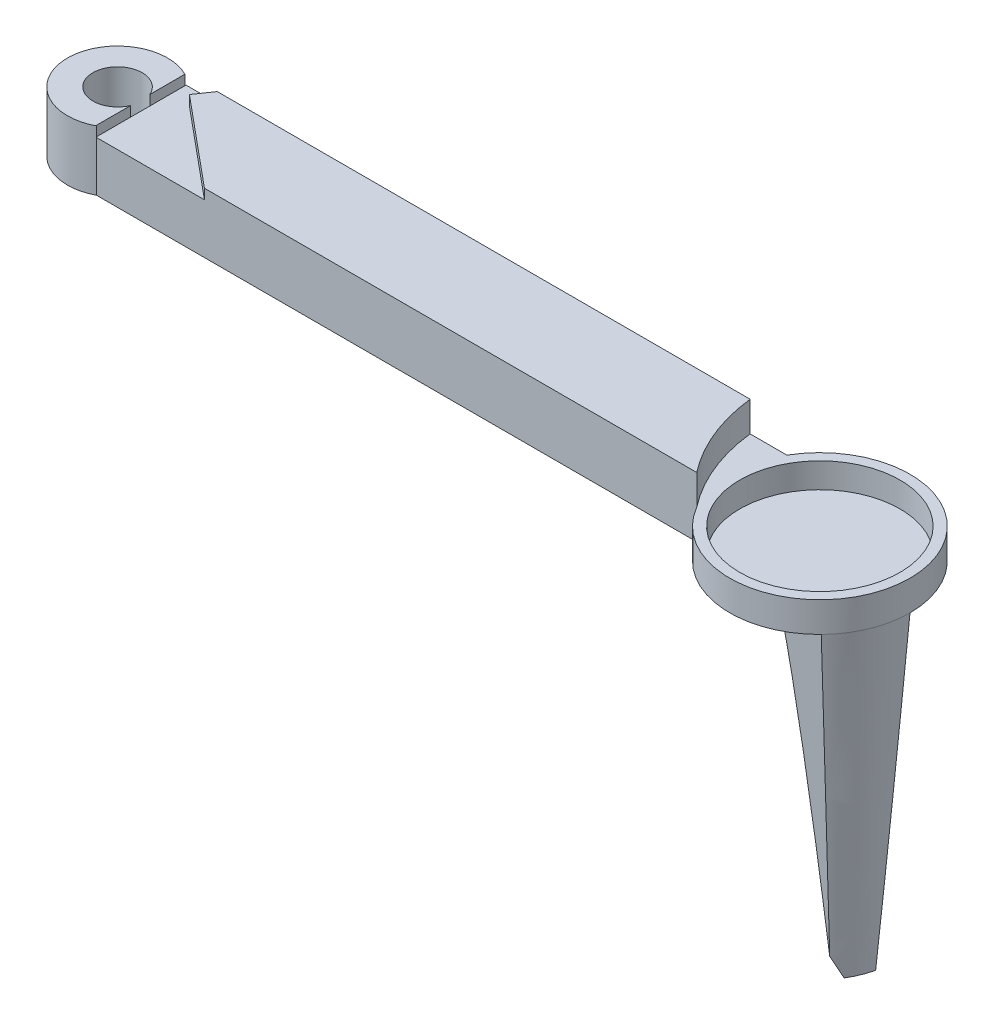
ISO-10303-21;
HEADER;
FILE_DESCRIPTION(('STEP AP214'),'2;1');
FILE_NAME('part.step','',(''),(''),'','','');
FILE_SCHEMA(('AUTOMOTIVE_DESIGN { 1 0 10303 214 1 1 1 1 }'));
ENDSEC;
DATA;
#1=APPLICATION_CONTEXT('core data for automotive mechanical design processes');
#2=APPLICATION_PROTOCOL_DEFINITION('international standard','automotive_design',2000,#1);
#3=PRODUCT_CONTEXT('',#1,'mechanical');
#4=PRODUCT('Part','Part','',(#3));
#5=PRODUCT_RELATED_PRODUCT_CATEGORY('part','',(#4));
#6=PRODUCT_DEFINITION_FORMATION('','',#4);
#7=PRODUCT_DEFINITION_CONTEXT('part definition',#1,'design');
#8=PRODUCT_DEFINITION('design','',#6,#7);
#9=PRODUCT_DEFINITION_SHAPE('','',#8);
#10=(LENGTH_UNIT() NAMED_UNIT(*) SI_UNIT(.MILLI.,.METRE.));
#11=(NAMED_UNIT(*) PLANE_ANGLE_UNIT() SI_UNIT($,.RADIAN.));
#12=(NAMED_UNIT(*) SI_UNIT($,.STERADIAN.) SOLID_ANGLE_UNIT());
#13=UNCERTAINTY_MEASURE_WITH_UNIT(LENGTH_MEASURE(1.E-05),#10,'distance_accuracy_value','');
#14=(GEOMETRIC_REPRESENTATION_CONTEXT(3) GLOBAL_UNCERTAINTY_ASSIGNED_CONTEXT((#13)) GLOBAL_UNIT_ASSIGNED_CONTEXT((#10,
#11,#12)) REPRESENTATION_CONTEXT('',''));
#15=CARTESIAN_POINT('',(0.,0.,0.));
#16=DIRECTION('',(0.,0.,1.));
#17=DIRECTION('',(1.,0.,0.));
#18=AXIS2_PLACEMENT_3D('',#15,#16,#17);
#19=CARTESIAN_POINT('',(0.,5.999999938,-9.));
#20=DIRECTION('',(0.,0.,1.));
#21=DIRECTION('',(1.,0.,0.));
#22=AXIS2_PLACEMENT_3D('',#19,#20,#21);
#23=PLANE('',#22);
#24=DIRECTION('',(0.,-1.,0.));
#25=VECTOR('',#24,1.);
#26=CARTESIAN_POINT('',(3.11768557129798,114.970307966617,-9.));
#27=LINE('',#26,#25);
#28=CARTESIAN_POINT('',(3.11768557129798,5.999999938,-9.));
#29=VERTEX_POINT('',#28);
#30=CARTESIAN_POINT('',(3.11768557129799,4.999999938,-9.));
#31=VERTEX_POINT('',#30);
#32=EDGE_CURVE('E349',#29,#31,#27,.T.);
#33=ORIENTED_EDGE('',*,*,#32,.F.);
#34=DIRECTION('',(-1.,0.,0.));
#35=VECTOR('',#34,1.);
#36=CARTESIAN_POINT('',(0.,5.999999938,-9.));
#37=LINE('',#36,#35);
#38=CARTESIAN_POINT('',(56.3307889829448,5.999999938,-9.));
#39=VERTEX_POINT('',#38);
#40=EDGE_CURVE('E280',#39,#29,#37,.T.);
#41=ORIENTED_EDGE('',*,*,#40,.F.);
#42=DIRECTION('',(0.,-1.,0.));
#43=VECTOR('',#42,1.);
#44=CARTESIAN_POINT('',(56.3307889829448,108.629294651588,-9.));
#45=LINE('',#44,#43);
#46=CARTESIAN_POINT('',(56.3307889829448,2.999999938,-9.));
#47=VERTEX_POINT('',#46);
#48=EDGE_CURVE('E335',#39,#47,#45,.T.);
#49=ORIENTED_EDGE('',*,*,#48,.T.);
#50=DIRECTION('',(-1.,0.,0.));
#51=VECTOR('',#50,1.);
#52=CARTESIAN_POINT('',(0.,2.999999938,-9.));
#53=LINE('',#52,#51);
#54=CARTESIAN_POINT('',(60.,2.999999938,-9.));
#55=VERTEX_POINT('',#54);
#56=EDGE_CURVE('E332',#55,#47,#53,.T.);
#57=ORIENTED_EDGE('',*,*,#56,.F.);
#58=DIRECTION('',(0.,-1.,0.));
#59=VECTOR('',#58,1.);
#60=CARTESIAN_POINT('',(60.,5.999999938,-9.));
#61=LINE('',#60,#59);
#62=CARTESIAN_POINT('',(60.,0.,-9.));
#63=VERTEX_POINT('',#62);
#64=EDGE_CURVE('E300',#55,#63,#61,.T.);
#65=ORIENTED_EDGE('',*,*,#64,.T.);
#66=DIRECTION('',(-1.,0.,0.));
#67=VECTOR('',#66,1.);
#68=CARTESIAN_POINT('',(0.,0.,-9.));
#69=LINE('',#68,#67);
#70=CARTESIAN_POINT('',(0.,0.,-9.));
#71=VERTEX_POINT('',#70);
#72=EDGE_CURVE('E281',#63,#71,#69,.T.);
#73=ORIENTED_EDGE('',*,*,#72,.T.);
#74=DIRECTION('',(0.,-1.,0.));
#75=VECTOR('',#74,1.);
#76=CARTESIAN_POINT('',(0.,5.999999938,-9.));
#77=LINE('',#76,#75);
#78=CARTESIAN_POINT('',(0.,4.999999938,-9.));
#79=VERTEX_POINT('',#78);
#80=EDGE_CURVE('E284',#79,#71,#77,.T.);
#81=ORIENTED_EDGE('',*,*,#80,.F.);
#82=DIRECTION('',(-1.,0.,0.));
#83=VECTOR('',#82,1.);
#84=CARTESIAN_POINT('',(0.,4.999999938,-9.));
#85=LINE('',#84,#83);
#86=EDGE_CURVE('E351',#31,#79,#85,.T.);
#87=ORIENTED_EDGE('',*,*,#86,.F.);
#88=EDGE_LOOP('',(#33,#41,#49,#57,#65,#73,#81,#87));
#89=FACE_BOUND('',#88,.T.);
#90=ADVANCED_FACE('F41',(#89),#23,.F.);
#91=CARTESIAN_POINT('',(0.,5.999999938,0.));
#92=DIRECTION('',(1.,0.,0.));
#93=DIRECTION('',(0.,0.,-1.));
#94=AXIS2_PLACEMENT_3D('',#91,#92,#93);
#95=PLANE('',#94);
#96=DIRECTION('',(0.,0.,1.));
#97=VECTOR('',#96,1.);
#98=CARTESIAN_POINT('',(0.,4.999999938,0.));
#99=LINE('',#98,#97);
#100=CARTESIAN_POINT('',(0.,4.999999938,-8.88252261781532));
#101=VERTEX_POINT('',#100);
#102=EDGE_CURVE('E371',#79,#101,#99,.T.);
#103=ORIENTED_EDGE('',*,*,#102,.F.);
#104=ORIENTED_EDGE('',*,*,#80,.T.);
#105=DIRECTION('',(0.,0.,1.));
#106=VECTOR('',#105,1.);
#107=CARTESIAN_POINT('',(0.,0.,0.));
#108=LINE('',#107,#106);
#109=CARTESIAN_POINT('',(0.,0.,-8.88252261781532));
#110=VERTEX_POINT('',#109);
#111=EDGE_CURVE('E293',#71,#110,#108,.T.);
#112=ORIENTED_EDGE('',*,*,#111,.T.);
#113=DIRECTION('',(0.,1.,0.));
#114=VECTOR('',#113,1.);
#115=CARTESIAN_POINT('',(0.,0.,-8.88252261781532));
#116=LINE('',#115,#114);
#117=EDGE_CURVE('E316',#101,#110,#116,.F.);
#118=ORIENTED_EDGE('',*,*,#117,.F.);
#119=EDGE_LOOP('',(#103,#104,#112,#118));
#120=FACE_BOUND('',#119,.T.);
#121=ADVANCED_FACE('F43',(#120),#95,.F.);
#122=CARTESIAN_POINT('',(67.7942286340599,5.999999938,-4.5));
#123=DIRECTION('',(0.,-1.,0.));
#124=DIRECTION('',(0.,0.,-1.));
#125=AXIS2_PLACEMENT_3D('',#122,#123,#124);
#126=PLANE('',#125);
#127=CARTESIAN_POINT('',(-2.26732885973922,5.999999938,-4.42615415887999));
#128=DIRECTION('',(0.,-1.,0.));
#129=DIRECTION('',(0.,0.,-1.));
#130=AXIS2_PLACEMENT_3D('',#127,#128,#129);
#131=CIRCLE('',#130,5.);
#132=CARTESIAN_POINT('',(0.0584310938736479,5.999999938,0.));
#133=VERTEX_POINT('',#132);
#134=CARTESIAN_POINT('',(0.,5.999999938,-8.88252261781532));
#135=VERTEX_POINT('',#134);
#136=EDGE_CURVE('E322',#133,#135,#131,.T.);
#137=ORIENTED_EDGE('',*,*,#136,.F.);
#138=DIRECTION('',(1.,0.,0.));
#139=VECTOR('',#138,1.);
#140=CARTESIAN_POINT('',(0.,5.999999938,0.));
#141=LINE('',#140,#139);
#142=CARTESIAN_POINT('',(0.,5.999999938,0.));
#143=VERTEX_POINT('',#142);
#144=EDGE_CURVE('E357',#143,#133,#141,.T.);
#145=ORIENTED_EDGE('',*,*,#144,.F.);
#146=DIRECTION('',(0.,0.,1.));
#147=VECTOR('',#146,1.);
#148=CARTESIAN_POINT('',(0.,5.999999938,0.));
#149=LINE('',#148,#147);
#150=CARTESIAN_POINT('',(0.,5.999999938,-3.47178534034408));
#151=VERTEX_POINT('',#150);
#152=EDGE_CURVE('E378',#151,#143,#149,.T.);
#153=ORIENTED_EDGE('',*,*,#152,.F.);
#154=CARTESIAN_POINT('',(-2.26732885973922,5.999999938,-4.42615415887999));
#155=DIRECTION('',(0.,1.,0.));
#156=DIRECTION('',(1.,0.,0.));
#157=AXIS2_PLACEMENT_3D('',#154,#155,#156);
#158=CIRCLE('',#157,2.46);
#159=CARTESIAN_POINT('',(0.,5.999999938,-5.38052297741591));
#160=VERTEX_POINT('',#159);
#161=EDGE_CURVE('E387',#151,#160,#158,.F.);
#162=ORIENTED_EDGE('',*,*,#161,.T.);
#163=EDGE_CURVE('E380',#135,#160,#149,.T.);
#164=ORIENTED_EDGE('',*,*,#163,.F.);
#165=EDGE_LOOP('',(#137,#145,#153,#162,#164));
#166=FACE_BOUND('',#165,.T.);
#167=ADVANCED_FACE('F250',(#166),#126,.F.);
#168=CARTESIAN_POINT('',(0.,4.999999938,-5.38052297741591));
#169=VERTEX_POINT('',#168);
#170=CARTESIAN_POINT('',(0.,4.999999938,-3.47178534034408));
#171=VERTEX_POINT('',#170);
#172=EDGE_CURVE('E416',#169,#171,#99,.T.);
#173=ORIENTED_EDGE('',*,*,#172,.F.);
#174=DIRECTION('',(0.,1.,0.));
#175=VECTOR('',#174,1.);
#176=CARTESIAN_POINT('',(0.,0.,-5.38052297741591));
#177=LINE('',#176,#175);
#178=CARTESIAN_POINT('',(0.,0.,-5.38052297741591));
#179=VERTEX_POINT('',#178);
#180=EDGE_CURVE('E329',#169,#179,#177,.F.);
#181=ORIENTED_EDGE('',*,*,#180,.T.);
#182=CARTESIAN_POINT('',(0.,0.,-3.47178534034408));
#183=VERTEX_POINT('',#182);
#184=EDGE_CURVE('E297',#179,#183,#108,.T.);
#185=ORIENTED_EDGE('',*,*,#184,.T.);
#186=DIRECTION('',(0.,1.,0.));
#187=VECTOR('',#186,1.);
#188=CARTESIAN_POINT('',(0.,0.,-3.47178534034408));
#189=LINE('',#188,#187);
#190=EDGE_CURVE('E326',#183,#171,#189,.T.);
#191=ORIENTED_EDGE('',*,*,#190,.T.);
#192=EDGE_LOOP('',(#173,#181,#185,#191));
#193=FACE_BOUND('',#192,.T.);
#194=ADVANCED_FACE('F252',(#193),#95,.F.);
#195=CARTESIAN_POINT('',(0.,5.999999938,0.));
#196=DIRECTION('',(0.,0.,-1.));
#197=DIRECTION('',(-1.,0.,0.));
#198=AXIS2_PLACEMENT_3D('',#195,#196,#197);
#199=PLANE('',#198);
#200=DIRECTION('',(1.,0.,0.));
#201=VECTOR('',#200,1.);
#202=CARTESIAN_POINT('',(0.,5.999999938,0.));
#203=LINE('',#202,#201);
#204=CARTESIAN_POINT('',(10.8365406297351,5.999999938,0.));
#205=VERTEX_POINT('',#204);
#206=CARTESIAN_POINT('',(60.,5.999999938,0.));
#207=VERTEX_POINT('',#206);
#208=EDGE_CURVE('E274',#205,#207,#203,.T.);
#209=ORIENTED_EDGE('',*,*,#208,.F.);
#210=DIRECTION('',(0.,1.,0.));
#211=VECTOR('',#210,1.);
#212=CARTESIAN_POINT('',(10.8365406297351,4.999999938,0.));
#213=LINE('',#212,#211);
#214=CARTESIAN_POINT('',(10.8365406297351,4.999999938,0.));
#215=VERTEX_POINT('',#214);
#216=EDGE_CURVE('E276',#215,#205,#213,.T.);
#217=ORIENTED_EDGE('',*,*,#216,.F.);
#218=DIRECTION('',(1.,0.,0.));
#219=VECTOR('',#218,1.);
#220=CARTESIAN_POINT('',(0.,4.999999938,0.));
#221=LINE('',#220,#219);
#222=CARTESIAN_POINT('',(0.0584310938736479,4.999999938,0.));
#223=VERTEX_POINT('',#222);
#224=EDGE_CURVE('E313',#223,#215,#221,.T.);
#225=ORIENTED_EDGE('',*,*,#224,.F.);
#226=DIRECTION('',(0.,1.,0.));
#227=VECTOR('',#226,1.);
#228=CARTESIAN_POINT('',(0.0584310938736479,0.,0.));
#229=LINE('',#228,#227);
#230=CARTESIAN_POINT('',(0.0584310938736479,0.,0.));
#231=VERTEX_POINT('',#230);
#232=EDGE_CURVE('E312',#231,#223,#229,.T.);
#233=ORIENTED_EDGE('',*,*,#232,.F.);
#234=DIRECTION('',(1.,0.,0.));
#235=VECTOR('',#234,1.);
#236=CARTESIAN_POINT('',(0.,0.,0.));
#237=LINE('',#236,#235);
#238=CARTESIAN_POINT('',(60.,0.,0.));
#239=VERTEX_POINT('',#238);
#240=EDGE_CURVE('E296',#231,#239,#237,.T.);
#241=ORIENTED_EDGE('',*,*,#240,.T.);
#242=DIRECTION('',(0.,-1.,0.));
#243=VECTOR('',#242,1.);
#244=CARTESIAN_POINT('',(60.,5.999999938,0.));
#245=LINE('',#244,#243);
#246=CARTESIAN_POINT('',(60.,2.999999938,0.));
#247=VERTEX_POINT('',#246);
#248=EDGE_CURVE('E49',#247,#239,#245,.T.);
#249=ORIENTED_EDGE('',*,*,#248,.F.);
#250=EDGE_CURVE('E11',#207,#247,#245,.T.);
#251=ORIENTED_EDGE('',*,*,#250,.F.);
#252=EDGE_LOOP('',(#209,#217,#225,#233,#241,#249,#251));
#253=FACE_BOUND('',#252,.T.);
#254=ADVANCED_FACE('F261',(#253),#199,.F.);
#255=ORIENTED_EDGE('',*,*,#40,.T.);
#256=DIRECTION('',(-0.567216915586704,0.,0.823568437151586));
#257=VECTOR('',#256,1.);
#258=CARTESIAN_POINT('',(1.98325174012457,5.999999938,-7.35286312569683));
#259=LINE('',#258,#257);
#260=CARTESIAN_POINT('',(1.98325174012457,5.999999938,-7.35286312569683));
#261=VERTEX_POINT('',#260);
#262=EDGE_CURVE('E359',#29,#261,#259,.T.);
#263=ORIENTED_EDGE('',*,*,#262,.T.);
#264=DIRECTION('',(-0.769283339281046,0.,-0.638907774177622));
#265=VECTOR('',#264,1.);
#266=CARTESIAN_POINT('',(0.,5.999999938,-9.));
#267=LINE('',#266,#265);
#268=EDGE_CURVE('E375',#205,#261,#267,.T.);
#269=ORIENTED_EDGE('',*,*,#268,.F.);
#270=ORIENTED_EDGE('',*,*,#208,.T.);
#271=CARTESIAN_POINT('',(74.0458842440092,5.999999938,-10.9743186618045));
#272=DIRECTION('',(0.,-1.,0.));
#273=DIRECTION('',(0.,0.,-1.));
#274=AXIS2_PLACEMENT_3D('',#271,#272,#273);
#275=CIRCLE('',#274,17.8247730500822);
#276=EDGE_CURVE('E336',#39,#207,#275,.F.);
#277=ORIENTED_EDGE('',*,*,#276,.F.);
#278=EDGE_LOOP('',(#255,#263,#269,#270,#277));
#279=FACE_BOUND('',#278,.T.);
#280=ADVANCED_FACE('F259',(#279),#126,.F.);
#281=CARTESIAN_POINT('',(67.7942286340599,5.999999938,-4.5));
#282=DIRECTION('',(0.,-1.,0.));
#283=DIRECTION('',(0.,0.,-1.));
#284=AXIS2_PLACEMENT_3D('',#281,#282,#283);
#285=CYLINDRICAL_SURFACE('',#284,9.);
#286=CARTESIAN_POINT('',(67.7942286340599,2.999999938,-4.5));
#287=DIRECTION('',(0.,1.,0.));
#288=DIRECTION('',(0.,0.,1.));
#289=AXIS2_PLACEMENT_3D('',#286,#287,#288);
#290=CIRCLE('',#289,9.);
#291=EDGE_CURVE('E290',#247,#55,#290,.T.);
#292=ORIENTED_EDGE('',*,*,#291,.F.);
#293=ORIENTED_EDGE('',*,*,#248,.T.);
#294=CARTESIAN_POINT('',(67.7942286340599,0.,-4.5));
#295=DIRECTION('',(0.,1.,0.));
#296=DIRECTION('',(0.,0.,-1.));
#297=AXIS2_PLACEMENT_3D('',#294,#295,#296);
#298=CIRCLE('',#297,9.);
#299=CARTESIAN_POINT('',(74.2267072312882,0.,1.79469769696688));
#300=VERTEX_POINT('',#299);
#301=EDGE_CURVE('E287',#239,#300,#298,.T.);
#302=ORIENTED_EDGE('',*,*,#301,.T.);
#303=CARTESIAN_POINT('',(67.7942286340599,0.,-4.50000000000003));
#304=DIRECTION('',(0.,-1.,0.));
#305=DIRECTION('',(0.,0.,1.));
#306=AXIS2_PLACEMENT_3D('',#303,#304,#305);
#307=CIRCLE('',#306,9.00000000000008);
#308=CARTESIAN_POINT('',(76.7942286340599,0.,-4.5));
#309=VERTEX_POINT('',#308);
#310=EDGE_CURVE('E185',#309,#300,#307,.T.);
#311=ORIENTED_EDGE('',*,*,#310,.F.);
#312=EDGE_CURVE('E61',#309,#63,#298,.T.);
#313=ORIENTED_EDGE('',*,*,#312,.T.);
#314=ORIENTED_EDGE('',*,*,#64,.F.);
#315=EDGE_LOOP('',(#292,#293,#302,#311,#313,#314));
#316=FACE_BOUND('',#315,.T.);
#317=ADVANCED_FACE('F257',(#316),#285,.T.);
#318=CARTESIAN_POINT('',(67.7942286340599,0.,-4.5));
#319=DIRECTION('',(0.,-1.,0.));
#320=DIRECTION('',(0.,0.,-1.));
#321=AXIS2_PLACEMENT_3D('',#318,#319,#320);
#322=PLANE('',#321);
#323=DIRECTION('',(1.,0.,0.));
#324=VECTOR('',#323,1.);
#325=CARTESIAN_POINT('',(76.7942286340599,0.,-4.5));
#326=LINE('',#325,#324);
#327=CARTESIAN_POINT('',(72.7942286340599,0.,-4.5));
#328=VERTEX_POINT('',#327);
#329=EDGE_CURVE('E56',#328,#309,#326,.T.);
#330=ORIENTED_EDGE('',*,*,#329,.F.);
#331=CARTESIAN_POINT('',(66.789088629436,0.,-3.27843742358938));
#332=DIRECTION('',(0.,1.,0.));
#333=DIRECTION('',(0.,0.,1.));
#334=AXIS2_PLACEMENT_3D('',#331,#332,#333);
#335=CIRCLE('',#334,6.12812545589774);
#336=CARTESIAN_POINT('',(70.2267072312882,0.,1.79469769696688));
#337=VERTEX_POINT('',#336);
#338=EDGE_CURVE('E165',#337,#328,#335,.T.);
#339=ORIENTED_EDGE('',*,*,#338,.F.);
#340=DIRECTION('',(-1.,0.,0.));
#341=VECTOR('',#340,1.);
#342=CARTESIAN_POINT('',(74.2267072312882,0.,1.79469769696688));
#343=LINE('',#342,#341);
#344=EDGE_CURVE('E170',#300,#337,#343,.T.);
#345=ORIENTED_EDGE('',*,*,#344,.F.);
#346=ORIENTED_EDGE('',*,*,#301,.F.);
#347=ORIENTED_EDGE('',*,*,#240,.F.);
#348=CARTESIAN_POINT('',(-2.26732885973922,0.,-4.42615415887999));
#349=DIRECTION('',(0.,-1.,0.));
#350=DIRECTION('',(0.,0.,-1.));
#351=AXIS2_PLACEMENT_3D('',#348,#349,#350);
#352=CIRCLE('',#351,5.);
#353=EDGE_CURVE('E309',#231,#110,#352,.T.);
#354=ORIENTED_EDGE('',*,*,#353,.T.);
#355=ORIENTED_EDGE('',*,*,#111,.F.);
#356=ORIENTED_EDGE('',*,*,#72,.F.);
#357=ORIENTED_EDGE('',*,*,#312,.F.);
#358=EDGE_LOOP('',(#330,#339,#345,#346,#347,#354,#355,#356,#357));
#359=FACE_BOUND('',#358,.T.);
#360=ORIENTED_EDGE('',*,*,#184,.F.);
#361=CARTESIAN_POINT('',(-2.26732885973922,0.,-4.42615415887999));
#362=DIRECTION('',(0.,1.,0.));
#363=DIRECTION('',(1.,0.,0.));
#364=AXIS2_PLACEMENT_3D('',#361,#362,#363);
#365=CIRCLE('',#364,2.46);
#366=EDGE_CURVE('E388',#183,#179,#365,.F.);
#367=ORIENTED_EDGE('',*,*,#366,.F.);
#368=EDGE_LOOP('',(#360,#367));
#369=FACE_BOUND('',#368,.T.);
#370=ADVANCED_FACE('F167',(#359,#369),#322,.T.);
#371=CARTESIAN_POINT('',(67.7942286340599,2.999999938,-4.5));
#372=DIRECTION('',(0.,1.,0.));
#373=DIRECTION('',(0.,0.,1.));
#374=AXIS2_PLACEMENT_3D('',#371,#372,#373);
#375=PLANE('',#374);
#376=CARTESIAN_POINT('',(67.7942286340599,2.999999938,-4.5));
#377=DIRECTION('',(0.,1.,0.));
#378=DIRECTION('',(0.,0.,1.));
#379=AXIS2_PLACEMENT_3D('',#376,#377,#378);
#380=CIRCLE('',#379,8.);
#381=CARTESIAN_POINT('',(67.7942286340599,2.999999938,3.49999999999999));
#382=VERTEX_POINT('',#381);
#383=EDGE_CURVE('E446',#382,#382,#380,.T.);
#384=ORIENTED_EDGE('',*,*,#383,.F.);
#385=EDGE_LOOP('',(#384));
#386=FACE_BOUND('',#385,.T.);
#387=ORIENTED_EDGE('',*,*,#291,.T.);
#388=ORIENTED_EDGE('',*,*,#56,.T.);
#389=CARTESIAN_POINT('',(74.0458842440092,2.999999938,-10.9743186618045));
#390=DIRECTION('',(0.,-1.,0.));
#391=DIRECTION('',(0.,0.,-1.));
#392=AXIS2_PLACEMENT_3D('',#389,#390,#391);
#393=CIRCLE('',#392,17.8247730500822);
#394=EDGE_CURVE('E333',#47,#247,#393,.F.);
#395=ORIENTED_EDGE('',*,*,#394,.T.);
#396=EDGE_LOOP('',(#387,#388,#395));
#397=FACE_BOUND('',#396,.T.);
#398=ADVANCED_FACE('F341',(#386,#397),#375,.T.);
#399=CARTESIAN_POINT('',(74.0458842440092,108.629294651588,-10.9743186618045));
#400=DIRECTION('',(0.,-1.,0.));
#401=DIRECTION('',(0.,0.,-1.));
#402=AXIS2_PLACEMENT_3D('',#399,#400,#401);
#403=CYLINDRICAL_SURFACE('',#402,17.8247730500822);
#404=ORIENTED_EDGE('',*,*,#276,.T.);
#405=ORIENTED_EDGE('',*,*,#250,.T.);
#406=ORIENTED_EDGE('',*,*,#394,.F.);
#407=ORIENTED_EDGE('',*,*,#48,.F.);
#408=EDGE_LOOP('',(#404,#405,#406,#407));
#409=FACE_BOUND('',#408,.T.);
#410=ADVANCED_FACE('F344',(#409),#403,.F.);
#411=CARTESIAN_POINT('',(-2.26732885973922,0.,-4.42615415887999));
#412=DIRECTION('',(0.,1.,0.));
#413=DIRECTION('',(0.,0.,1.));
#414=AXIS2_PLACEMENT_3D('',#411,#412,#413);
#415=CYLINDRICAL_SURFACE('',#414,2.46);
#416=EDGE_CURVE('E330',#160,#169,#177,.F.);
#417=ORIENTED_EDGE('',*,*,#416,.F.);
#418=ORIENTED_EDGE('',*,*,#161,.F.);
#419=DIRECTION('',(0.,1.,0.));
#420=VECTOR('',#419,1.);
#421=CARTESIAN_POINT('',(0.,0.,-3.47178534034408));
#422=LINE('',#421,#420);
#423=EDGE_CURVE('E384',#171,#151,#422,.T.);
#424=ORIENTED_EDGE('',*,*,#423,.F.);
#425=ORIENTED_EDGE('',*,*,#190,.F.);
#426=ORIENTED_EDGE('',*,*,#366,.T.);
#427=ORIENTED_EDGE('',*,*,#180,.F.);
#428=EDGE_LOOP('',(#417,#418,#424,#425,#426,#427));
#429=FACE_BOUND('',#428,.T.);
#430=ADVANCED_FACE('F430',(#429),#415,.F.);
#431=CARTESIAN_POINT('',(-2.26732885973922,0.,-4.42615415887999));
#432=DIRECTION('',(0.,1.,0.));
#433=DIRECTION('',(0.,0.,1.));
#434=AXIS2_PLACEMENT_3D('',#431,#432,#433);
#435=CYLINDRICAL_SURFACE('',#434,5.);
#436=ORIENTED_EDGE('',*,*,#136,.T.);
#437=EDGE_CURVE('E319',#135,#101,#116,.F.);
#438=ORIENTED_EDGE('',*,*,#437,.T.);
#439=ORIENTED_EDGE('',*,*,#117,.T.);
#440=ORIENTED_EDGE('',*,*,#353,.F.);
#441=ORIENTED_EDGE('',*,*,#232,.T.);
#442=EDGE_CURVE('E317',#223,#133,#229,.T.);
#443=ORIENTED_EDGE('',*,*,#442,.T.);
#444=EDGE_LOOP('',(#436,#438,#439,#440,#441,#443));
#445=FACE_BOUND('',#444,.T.);
#446=ADVANCED_FACE('F399',(#445),#435,.T.);
#447=CARTESIAN_POINT('',(0.,4.999999938,0.));
#448=DIRECTION('',(0.,0.,1.));
#449=DIRECTION('',(1.,0.,0.));
#450=AXIS2_PLACEMENT_3D('',#447,#448,#449);
#451=PLANE('',#450);
#452=CARTESIAN_POINT('',(0.,4.999999938,0.));
#453=VERTEX_POINT('',#452);
#454=EDGE_CURVE('E364',#453,#223,#221,.T.);
#455=ORIENTED_EDGE('',*,*,#454,.F.);
#456=DIRECTION('',(0.,1.,0.));
#457=VECTOR('',#456,1.);
#458=CARTESIAN_POINT('',(0.,4.999999938,0.));
#459=LINE('',#458,#457);
#460=EDGE_CURVE('E381',#453,#143,#459,.T.);
#461=ORIENTED_EDGE('',*,*,#460,.T.);
#462=ORIENTED_EDGE('',*,*,#144,.T.);
#463=ORIENTED_EDGE('',*,*,#442,.F.);
#464=EDGE_LOOP('',(#455,#461,#462,#463));
#465=FACE_BOUND('',#464,.T.);
#466=ADVANCED_FACE('F422',(#465),#451,.F.);
#467=CARTESIAN_POINT('',(0.,4.999999938,0.));
#468=DIRECTION('',(-1.,0.,0.));
#469=DIRECTION('',(0.,0.,1.));
#470=AXIS2_PLACEMENT_3D('',#467,#468,#469);
#471=PLANE('',#470);
#472=ORIENTED_EDGE('',*,*,#423,.T.);
#473=ORIENTED_EDGE('',*,*,#152,.T.);
#474=ORIENTED_EDGE('',*,*,#460,.F.);
#475=EDGE_CURVE('E370',#171,#453,#99,.T.);
#476=ORIENTED_EDGE('',*,*,#475,.F.);
#477=EDGE_LOOP('',(#472,#473,#474,#476));
#478=FACE_BOUND('',#477,.T.);
#479=ADVANCED_FACE('F420',(#478),#471,.F.);
#480=ORIENTED_EDGE('',*,*,#416,.T.);
#481=EDGE_CURVE('E373',#101,#169,#99,.T.);
#482=ORIENTED_EDGE('',*,*,#481,.F.);
#483=ORIENTED_EDGE('',*,*,#437,.F.);
#484=ORIENTED_EDGE('',*,*,#163,.T.);
#485=EDGE_LOOP('',(#480,#482,#483,#484));
#486=FACE_BOUND('',#485,.T.);
#487=ADVANCED_FACE('F415',(#486),#471,.F.);
#488=CARTESIAN_POINT('',(0.,4.999999938,-9.));
#489=DIRECTION('',(0.638907774177622,0.,-0.769283339281046));
#490=DIRECTION('',(-0.769283339281046,0.,-0.638907774177622));
#491=AXIS2_PLACEMENT_3D('',#488,#489,#490);
#492=PLANE('',#491);
#493=ORIENTED_EDGE('',*,*,#268,.T.);
#494=DIRECTION('',(0.,-1.,0.));
#495=VECTOR('',#494,1.);
#496=CARTESIAN_POINT('',(1.98325174012457,114.970307966617,-7.35286312569683));
#497=LINE('',#496,#495);
#498=CARTESIAN_POINT('',(1.98325174012457,4.999999938,-7.35286312569683));
#499=VERTEX_POINT('',#498);
#500=EDGE_CURVE('E353',#261,#499,#497,.T.);
#501=ORIENTED_EDGE('',*,*,#500,.T.);
#502=DIRECTION('',(-0.769283339281046,0.,-0.638907774177622));
#503=VECTOR('',#502,1.);
#504=CARTESIAN_POINT('',(0.,4.999999938,-9.));
#505=LINE('',#504,#503);
#506=EDGE_CURVE('E367',#215,#499,#505,.T.);
#507=ORIENTED_EDGE('',*,*,#506,.F.);
#508=ORIENTED_EDGE('',*,*,#216,.T.);
#509=EDGE_LOOP('',(#493,#501,#507,#508));
#510=FACE_BOUND('',#509,.T.);
#511=ADVANCED_FACE('F407',(#510),#492,.F.);
#512=CARTESIAN_POINT('',(0.,4.999999938,0.));
#513=DIRECTION('',(0.,1.,0.));
#514=DIRECTION('',(0.,0.,1.));
#515=AXIS2_PLACEMENT_3D('',#512,#513,#514);
#516=PLANE('',#515);
#517=ORIENTED_EDGE('',*,*,#454,.T.);
#518=ORIENTED_EDGE('',*,*,#224,.T.);
#519=ORIENTED_EDGE('',*,*,#506,.T.);
#520=DIRECTION('',(-0.567216915586704,0.,0.823568437151586));
#521=VECTOR('',#520,1.);
#522=CARTESIAN_POINT('',(1.98325174012457,4.999999938,-7.35286312569683));
#523=LINE('',#522,#521);
#524=EDGE_CURVE('E354',#31,#499,#523,.T.);
#525=ORIENTED_EDGE('',*,*,#524,.F.);
#526=ORIENTED_EDGE('',*,*,#86,.T.);
#527=ORIENTED_EDGE('',*,*,#102,.T.);
#528=ORIENTED_EDGE('',*,*,#481,.T.);
#529=ORIENTED_EDGE('',*,*,#172,.T.);
#530=ORIENTED_EDGE('',*,*,#475,.T.);
#531=EDGE_LOOP('',(#517,#518,#519,#525,#526,#527,#528,#529,#530));
#532=FACE_BOUND('',#531,.T.);
#533=ADVANCED_FACE('F404',(#532),#516,.T.);
#534=CARTESIAN_POINT('',(1.98325174012457,114.970307966617,-7.35286312569683));
#535=DIRECTION('',(-0.823568437151586,0.,-0.567216915586704));
#536=DIRECTION('',(-0.567216915586704,0.,0.823568437151586));
#537=AXIS2_PLACEMENT_3D('',#534,#535,#536);
#538=PLANE('',#537);
#539=ORIENTED_EDGE('',*,*,#262,.F.);
#540=ORIENTED_EDGE('',*,*,#32,.T.);
#541=ORIENTED_EDGE('',*,*,#524,.T.);
#542=ORIENTED_EDGE('',*,*,#500,.F.);
#543=EDGE_LOOP('',(#539,#540,#541,#542));
#544=FACE_BOUND('',#543,.T.);
#545=ADVANCED_FACE('F408',(#544),#538,.T.);
#546=CARTESIAN_POINT('',(67.7942286340599,0.,-4.50000000000003));
#547=DIRECTION('',(0.,1.,0.));
#548=DIRECTION('',(0.,0.,1.));
#549=AXIS2_PLACEMENT_3D('',#546,#547,#548);
#550=CONICAL_SURFACE('',#549,9.00000000000008,0.05235987755983);
#551=CARTESIAN_POINT('',(74.6824700033117,-39.1277618245113,-5.41994762398317));
#552=CARTESIAN_POINT('',(74.6981423654363,-39.0277767007323,-5.34215851059436));
#553=CARTESIAN_POINT('',(74.7124041615653,-38.9270529719989,-5.26505067795176));
#554=CARTESIAN_POINT('',(74.7382741705585,-38.7242825238941,-5.11215980281693));
#555=CARTESIAN_POINT('',(74.7498826411595,-38.6222359340404,-5.03637663231153));
#556=CARTESIAN_POINT('',(74.7809721693503,-38.3144256764915,-4.81101692517996));
#557=CARTESIAN_POINT('',(74.7967340584829,-38.1068822085539,-4.66334549218889));
#558=CARTESIAN_POINT('',(74.8194131702271,-37.6884062446213,-4.37308071306717));
#559=CARTESIAN_POINT('',(74.8263468256162,-37.4774807873969,-4.23047841390796));
#560=CARTESIAN_POINT('',(74.8322986873211,-37.0525234064128,-3.94977070262138));
#561=CARTESIAN_POINT('',(74.8313157399066,-36.8384910344023,-3.81166594889093));
#562=CARTESIAN_POINT('',(74.8176557218883,-36.1953050582618,-3.4054584763041));
#563=CARTESIAN_POINT('',(74.794391397553,-35.7623881584418,-3.14362478863307));
#564=CARTESIAN_POINT('',(74.7237677414022,-34.8894958983935,-2.63520238399906));
#565=CARTESIAN_POINT('',(74.676397623185,-34.4495174638307,-2.38862054708841));
#566=CARTESIAN_POINT('',(74.5859417891197,-33.7591388573012,-2.01497362173831));
#567=CARTESIAN_POINT('',(74.5501218056739,-33.5103985396311,-1.88300735674465));
#568=CARTESIAN_POINT('',(74.4722164152575,-33.0117143840589,-1.6234490919649));
#569=CARTESIAN_POINT('',(74.430132920657,-32.7617709359565,-1.49585577161274));
#570=CARTESIAN_POINT('',(74.3399362121375,-32.2603660777462,-1.24464536986588));
#571=CARTESIAN_POINT('',(74.2918116251822,-32.0089026792102,-1.1210363560125));
#572=CARTESIAN_POINT('',(74.1898513921612,-31.5050732463084,-0.877931728049186));
#573=CARTESIAN_POINT('',(74.1360143083752,-31.2527070002303,-0.758437159532811));
#574=CARTESIAN_POINT('',(73.9752037809805,-30.5344281132942,-0.424572147158515));
#575=CARTESIAN_POINT('',(73.8616707927244,-30.0676996347927,-0.215069599175578));
#576=CARTESIAN_POINT('',(73.6170249301495,-29.1328917480401,0.190347010212615));
#577=CARTESIAN_POINT('',(73.4859092956898,-28.6648121389987,0.386258930806734));
#578=CARTESIAN_POINT('',(73.2066559519508,-27.7279827684278,0.764511424405386));
#579=CARTESIAN_POINT('',(73.0585106298861,-27.2592328004198,0.946845867382313));
#580=CARTESIAN_POINT('',(72.7455248883979,-26.3220816267753,1.29755114528633));
#581=CARTESIAN_POINT('',(72.5806845289581,-25.8536804198917,1.46592203037924));
#582=CARTESIAN_POINT('',(72.2349412613012,-24.9198711956064,1.78750436305328));
#583=CARTESIAN_POINT('',(72.0541028697506,-24.4544586056154,1.94077186471027));
#584=CARTESIAN_POINT('',(71.6754834760481,-23.5257569074162,2.23198774734503));
#585=CARTESIAN_POINT('',(71.4777044145499,-23.0624675623664,2.36993787887158));
#586=CARTESIAN_POINT('',(71.1678333345977,-22.3700392722223,2.56437336426883));
#587=CARTESIAN_POINT('',(71.062352346,-22.1396674684499,2.6270986424359));
#588=CARTESIAN_POINT('',(70.8468486674963,-21.6799030714849,2.74817660652648));
#589=CARTESIAN_POINT('',(70.7368261215901,-21.4505104474995,2.80652943092307));
#590=CARTESIAN_POINT('',(70.5120461769129,-20.9928073964326,2.91863671567767));
#591=CARTESIAN_POINT('',(70.3972869971061,-20.7644974130833,2.97238942254779));
#592=CARTESIAN_POINT('',(70.1628677213804,-20.3092637226099,3.07496247293882));
#593=CARTESIAN_POINT('',(70.0432071661647,-20.0823401477032,3.1237823527227));
#594=CARTESIAN_POINT('',(69.9210041018217,-19.8562394335714,3.16997611410615));
#595=B_SPLINE_CURVE_WITH_KNOTS('',3,(#551,#552,#553,#554,#555,#556,#557,#558,#559,#560,#561,
#562,#563,#564,#565,#566,#567,#568,#569,#570,#571,#572,#573,#574,#575,#576,#577,#578,#579,#580,
#581,#582,#583,#584,#585,#586,#587,#588,#589,#590,#591,#592,#593,#594),.UNSPECIFIED.,.F.,.F.,(4,
2,2,2,2,2,2,2,2,2,2,2,2,2,2,2,2,2,2,2,2,4),(0.,0.382913363312512,0.765789515614922,
1.53112439520309,2.29503259617437,3.05905212773521,4.57737130046843,6.09637045992774,
6.94782221879107,7.79901454437367,8.65183406823435,9.50486874098747,11.076447532462,
12.6482733213194,14.220804516543,15.7933300620068,17.3597802912675,18.9260513137815,
19.7090501054555,20.49202408952,21.2752952130116,22.0586399037542),.UNSPECIFIED.);
#596=CARTESIAN_POINT('',(74.079437473496,-31.,-0.640975784440944));
#597=VERTEX_POINT('',#596);
#598=CARTESIAN_POINT('',(73.5542070547724,-28.9162573093628,0.279260866206166));
#599=VERTEX_POINT('',#598);
#600=EDGE_CURVE('E189',#597,#599,#595,.T.);
#601=ORIENTED_EDGE('',*,*,#600,.F.);
#602=CARTESIAN_POINT('',(67.7942286340599,-31.,-4.50000000000003));
#603=DIRECTION('',(0.,1.,0.));
#604=DIRECTION('',(0.,0.,1.));
#605=AXIS2_PLACEMENT_3D('',#602,#603,#604);
#606=CIRCLE('',#605,7.3753588422258);
#607=CARTESIAN_POINT('',(74.9884248476798,-31.,-2.87535884222572));
#608=VERTEX_POINT('',#607);
#609=EDGE_CURVE('E208',#608,#597,#606,.F.);
#610=ORIENTED_EDGE('',*,*,#609,.F.);
#611=CARTESIAN_POINT('',(74.9884248476798,-31.,-2.87535884222572));
#612=CARTESIAN_POINT('',(75.0647362981899,-29.835982799968,-2.93636239872666));
#613=CARTESIAN_POINT('',(75.1398479675691,-28.6718877012613,-2.99737003772415));
#614=CARTESIAN_POINT('',(75.2878631718863,-26.3435582465811,-3.11939261388324));
#615=CARTESIAN_POINT('',(75.3607667083225,-25.1793238907025,-3.18040755103985));
#616=CARTESIAN_POINT('',(75.5764510130359,-21.6864570372879,-3.36346094615866));
#617=CARTESIAN_POINT('',(75.7162069544459,-19.3576380991301,-3.4855091750598));
#618=CARTESIAN_POINT('',(76.0186200456538,-14.1910466258091,-3.75627876063925));
#619=CARTESIAN_POINT('',(76.1796143662493,-11.3531772293366,-3.90500519360368));
#620=CARTESIAN_POINT('',(76.414679524235,-7.0960042226887,-4.1281141769058));
#621=CARTESIAN_POINT('',(76.4919639759832,-5.67687639017998,-4.20248751512634));
#622=CARTESIAN_POINT('',(76.6445467708391,-2.83851501014399,-4.35123973185677));
#623=CARTESIAN_POINT('',(76.7198451150589,-1.41928146267638,-4.42561861036355));
#624=CARTESIAN_POINT('',(76.7942286340599,0.,-4.5));
#625=B_SPLINE_CURVE_WITH_KNOTS('',3,(#611,#612,#613,#614,#615,#616,#617,#618,#619,#620,#621,
#622,#623,#624),.UNSPECIFIED.,.F.,.F.,(4,2,2,2,2,2,4),(0.,3.50432844415595,7.00865451036202,
14.0172384411515,22.5561839517503,26.8257089188959,31.0952314952104),.UNSPECIFIED.);
#626=EDGE_CURVE('E193',#608,#309,#625,.T.);
#627=ORIENTED_EDGE('',*,*,#626,.T.);
#628=ORIENTED_EDGE('',*,*,#310,.T.);
#629=CARTESIAN_POINT('',(73.5026863918384,-31.,0.1700565391926));
#630=CARTESIAN_POINT('',(73.5606088595588,-28.6677310892529,0.292285573495736));
#631=CARTESIAN_POINT('',(73.6176568468793,-26.3354406293979,0.414515737139755));
#632=CARTESIAN_POINT('',(73.7301382397139,-21.6708218966954,0.658978046122771));
#633=CARTESIAN_POINT('',(73.7855716459401,-19.3384936238649,0.781210191460869));
#634=CARTESIAN_POINT('',(73.9067293378293,-14.1718379437825,1.05198314197409));
#635=CARTESIAN_POINT('',(73.9721007873396,-11.3375022921119,1.20052437922091));
#636=CARTESIAN_POINT('',(74.1008506291931,-5.66878430337878,1.49760930039224));
#637=CARTESIAN_POINT('',(74.1642290204682,-2.83440196629218,1.64615298431802));
#638=CARTESIAN_POINT('',(74.2267072312882,0.,1.79469769696688));
#639=B_SPLINE_CURVE_WITH_KNOTS('',3,(#629,#630,#631,#632,#633,#634,#635,#636,#637,#638),
.UNSPECIFIED.,.F.,.F.,(4,2,2,2,4),(0.,7.00856293528458,14.0171227788933,22.5340562669946,
31.0509943197275),.UNSPECIFIED.);
#640=EDGE_CURVE('E183',#599,#300,#639,.T.);
#641=ORIENTED_EDGE('',*,*,#640,.F.);
#642=EDGE_LOOP('',(#601,#610,#627,#628,#641));
#643=FACE_BOUND('',#642,.T.);
#644=ADVANCED_FACE('F216',(#643),#550,.T.);
#645=CARTESIAN_POINT('',(74.2267072312882,0.,1.79469769696688));
#646=DIRECTION('',(0.,-0.0523359562429439,0.998629534754574));
#647=DIRECTION('',(0.,-0.998629534754574,-0.052335956242944));
#648=AXIS2_PLACEMENT_3D('',#645,#646,#647);
#649=PLANE('',#648);
#650=ORIENTED_EDGE('',*,*,#344,.T.);
#651=CARTESIAN_POINT('',(73.732666925583,-31.,0.1700565391926));
#652=CARTESIAN_POINT('',(73.6293134873062,-29.7778998253955,0.234104095405038));
#653=CARTESIAN_POINT('',(73.5237328244206,-28.5559839246353,0.298141994234517));
#654=CARTESIAN_POINT('',(73.30729535236,-26.1126330289143,0.426192588688486));
#655=CARTESIAN_POINT('',(73.1964386041177,-24.8911980285638,0.490205284595438));
#656=CARTESIAN_POINT('',(72.9686605189871,-22.4492747565893,0.618181060459195));
#657=CARTESIAN_POINT('',(72.8517410885109,-21.2287863083815,0.682144149670374));
#658=CARTESIAN_POINT('',(72.6106603200174,-18.7884981975743,0.810034230368586));
#659=CARTESIAN_POINT('',(72.4864988430516,-17.5686985486442,0.873961221139246));
#660=CARTESIAN_POINT('',(72.2139474610026,-14.9830057835368,1.00947163686675));
#661=CARTESIAN_POINT('',(72.0644412174401,-13.6172288002415,1.08104897555715));
#662=CARTESIAN_POINT('',(71.829626427339,-11.5698029044673,1.18835002000127));
#663=CARTESIAN_POINT('',(71.7495974815115,-10.8875492910083,1.22410541679049));
#664=CARTESIAN_POINT('',(71.5854645544994,-9.52352567008439,1.29559086565272));
#665=CARTESIAN_POINT('',(71.5013605507057,-8.84175566532399,1.331320917584));
#666=CARTESIAN_POINT('',(71.3283665328614,-7.47856831733668,1.40276253923875));
#667=CARTESIAN_POINT('',(71.2394747941608,-6.79715119167697,1.43847409756001));
#668=CARTESIAN_POINT('',(71.0560302585156,-5.43508612039338,1.50985690318498));
#669=CARTESIAN_POINT('',(70.961477551904,-4.75443816267225,1.54552815112268));
#670=CARTESIAN_POINT('',(70.7654753455143,-3.39401837042384,1.61682473132712));
#671=CARTESIAN_POINT('',(70.6640247830828,-2.71424668740293,1.65245005565374));
#672=CARTESIAN_POINT('',(70.5053678658818,-1.69557738929754,1.70583625139126));
#673=CARTESIAN_POINT('',(70.451400480852,-1.35617637773457,1.72362350469369));
#674=CARTESIAN_POINT('',(70.3409896771753,-0.677772128625286,1.75917716484569));
#675=CARTESIAN_POINT('',(70.2845462265728,-0.338768896270643,1.77694357142317));
#676=CARTESIAN_POINT('',(70.2267072312882,0.,1.79469769696688));
#677=B_SPLINE_CURVE_WITH_KNOTS('',3,(#651,#652,#653,#654,#655,#656,#657,#658,#659,#660,#661,
#662,#663,#664,#665,#666,#667,#668,#669,#670,#671,#672,#673,#674,#675,#676),.UNSPECIFIED.,.F.,
.F.,(4,2,2,2,2,2,2,2,2,2,2,2,4),(0.,3.68440484365213,7.36876714694159,11.0519778453706,
14.7352592344824,18.8625901288945,20.9261642198329,22.9897497611423,25.0540836897957,
27.1183846862795,29.1830044236359,30.2153708505947,31.2477506049781),.UNSPECIFIED.);
#678=EDGE_CURVE('E181',#599,#337,#677,.T.);
#679=ORIENTED_EDGE('',*,*,#678,.F.);
#680=ORIENTED_EDGE('',*,*,#640,.T.);
#681=EDGE_LOOP('',(#650,#679,#680));
#682=FACE_BOUND('',#681,.T.);
#683=ADVANCED_FACE('F180',(#682),#649,.T.);
#684=CARTESIAN_POINT('',(66.789088629436,0.,-3.27843742358938));
#685=DIRECTION('',(0.,-1.,0.));
#686=DIRECTION('',(0.,0.,1.));
#687=AXIS2_PLACEMENT_3D('',#684,#685,#686);
#688=CONICAL_SURFACE('',#687,6.12812545589774,0.05235987755983);
#689=CARTESIAN_POINT('',(66.789088629436,-31.,-3.27843742358938));
#690=DIRECTION('',(0.,1.,0.));
#691=DIRECTION('',(0.,0.,1.));
#692=AXIS2_PLACEMENT_3D('',#689,#690,#691);
#693=CIRCLE('',#692,7.75276661367202);
#694=CARTESIAN_POINT('',(74.5313698064092,-31.,-2.87535884222572));
#695=VERTEX_POINT('',#694);
#696=EDGE_CURVE('E458',#597,#695,#693,.T.);
#697=ORIENTED_EDGE('',*,*,#696,.F.);
#698=ORIENTED_EDGE('',*,*,#600,.T.);
#699=ORIENTED_EDGE('',*,*,#678,.T.);
#700=ORIENTED_EDGE('',*,*,#338,.T.);
#701=CARTESIAN_POINT('',(74.5313698064092,-31.,-2.87535884222572));
#702=CARTESIAN_POINT('',(74.4704399764745,-29.7753146982215,-2.93954187921251));
#703=CARTESIAN_POINT('',(74.4087958483908,-28.5506649838007,-3.00372305114492));
#704=CARTESIAN_POINT('',(74.2839638810545,-26.1014433217277,-3.13208131942608));
#705=CARTESIAN_POINT('',(74.2207760408945,-24.8768713741217,-3.19625841577242));
#706=CARTESIAN_POINT('',(74.0287259330306,-21.2033137751903,-3.38878141160076));
#707=CARTESIAN_POINT('',(73.897375613368,-18.7544568179391,-3.51712056651212));
#708=CARTESIAN_POINT('',(73.6870361334131,-14.9466833336008,-3.71667751883914));
#709=CARTESIAN_POINT('',(73.610753300305,-13.587617374756,-3.78790314764137));
#710=CARTESIAN_POINT('',(73.455518299529,-10.8696376933228,-3.93034642688171));
#711=CARTESIAN_POINT('',(73.3765661327649,-9.51072397068294,-4.00156407732252));
#712=CARTESIAN_POINT('',(73.2156972062308,-6.79305386634831,-4.14399113231461));
#713=CARTESIAN_POINT('',(73.1337804088189,-5.43429748687123,-4.21520053674967));
#714=CARTESIAN_POINT('',(72.9666051879417,-2.7169881153766,-4.3576086865347));
#715=CARTESIAN_POINT('',(72.8813467600923,-1.35843512362825,-4.42880743187056));
#716=CARTESIAN_POINT('',(72.7942286340599,0.,-4.5));
#717=B_SPLINE_CURVE_WITH_KNOTS('',3,(#701,#702,#703,#704,#705,#706,#707,#708,#709,#710,#711,
#712,#713,#714,#715,#716),.UNSPECIFIED.,.F.,.F.,(4,2,2,2,2,2,2,4),(0.,3.68363538462013,
7.36727293482747,14.7344591557279,18.8236589386077,22.912857336823,27.0021076739536,
31.0913633762656),.UNSPECIFIED.);
#718=EDGE_CURVE('E190',#695,#328,#717,.T.);
#719=ORIENTED_EDGE('',*,*,#718,.F.);
#720=EDGE_LOOP('',(#697,#698,#699,#700,#719));
#721=FACE_BOUND('',#720,.T.);
#722=ADVANCED_FACE('F188',(#721),#688,.F.);
#723=CARTESIAN_POINT('',(76.7942286340599,0.,-4.5));
#724=DIRECTION('',(0.,-0.0523359562429439,-0.998629534754574));
#725=DIRECTION('',(0.,0.998629534754574,-0.052335956242944));
#726=AXIS2_PLACEMENT_3D('',#723,#724,#725);
#727=PLANE('',#726);
#728=ORIENTED_EDGE('',*,*,#329,.T.);
#729=ORIENTED_EDGE('',*,*,#626,.F.);
#730=DIRECTION('',(-1.,0.,0.));
#731=VECTOR('',#730,1.);
#732=CARTESIAN_POINT('',(67.7942286340599,-31.,-2.87535884222572));
#733=LINE('',#732,#731);
#734=EDGE_CURVE('E231',#695,#608,#733,.F.);
#735=ORIENTED_EDGE('',*,*,#734,.F.);
#736=ORIENTED_EDGE('',*,*,#718,.T.);
#737=EDGE_LOOP('',(#728,#729,#735,#736));
#738=FACE_BOUND('',#737,.T.);
#739=ADVANCED_FACE('F232',(#738),#727,.T.);
#740=CARTESIAN_POINT('',(67.7942286340599,-31.,-4.50000000000003));
#741=DIRECTION('',(0.,1.,0.));
#742=DIRECTION('',(0.,0.,1.));
#743=AXIS2_PLACEMENT_3D('',#740,#741,#742);
#744=PLANE('',#743);
#745=ORIENTED_EDGE('',*,*,#609,.T.);
#746=ORIENTED_EDGE('',*,*,#696,.T.);
#747=ORIENTED_EDGE('',*,*,#734,.T.);
#748=EDGE_LOOP('',(#745,#746,#747));
#749=FACE_BOUND('',#748,.T.);
#750=ADVANCED_FACE('F217',(#749),#744,.F.);
#751=CARTESIAN_POINT('',(67.7942286340599,0.499999937999999,-4.5));
#752=DIRECTION('',(0.,1.,0.));
#753=DIRECTION('',(0.,0.,1.));
#754=AXIS2_PLACEMENT_3D('',#751,#752,#753);
#755=CYLINDRICAL_SURFACE('',#754,8.);
#756=CARTESIAN_POINT('',(67.7942286340599,0.499999937999999,-4.5));
#757=DIRECTION('',(0.,1.,0.));
#758=DIRECTION('',(0.,0.,1.));
#759=AXIS2_PLACEMENT_3D('',#756,#757,#758);
#760=CIRCLE('',#759,8.);
#761=CARTESIAN_POINT('',(67.7942286340599,0.499999937999999,3.49999999999999));
#762=VERTEX_POINT('',#761);
#763=EDGE_CURVE('E448',#762,#762,#760,.T.);
#764=ORIENTED_EDGE('',*,*,#763,.F.);
#765=EDGE_LOOP('',(#764));
#766=FACE_BOUND('',#765,.T.);
#767=ORIENTED_EDGE('',*,*,#383,.T.);
#768=EDGE_LOOP('',(#767));
#769=FACE_BOUND('',#768,.T.);
#770=ADVANCED_FACE('F241',(#766,#769),#755,.F.);
#771=CARTESIAN_POINT('',(67.7942286340599,0.499999937999999,-4.5));
#772=DIRECTION('',(0.,1.,0.));
#773=DIRECTION('',(0.,0.,1.));
#774=AXIS2_PLACEMENT_3D('',#771,#772,#773);
#775=PLANE('',#774);
#776=ORIENTED_EDGE('',*,*,#763,.T.);
#777=EDGE_LOOP('',(#776));
#778=FACE_BOUND('',#777,.T.);
#779=ADVANCED_FACE('F613',(#778),#775,.T.);
#780=CLOSED_SHELL('',(#90,#121,#167,#194,#254,#280,#317,#370,#398,#410,#430,#446,#466,#479,#487,
#511,#533,#545,#644,#683,#722,#739,#750,#770,#779));
#781=MANIFOLD_SOLID_BREP('B2',#780);
#782=ADVANCED_BREP_SHAPE_REPRESENTATION('',(#18,#781),#14);
#783=SHAPE_DEFINITION_REPRESENTATION(#9,#782);
ENDSEC;
END-ISO-10303-21;
